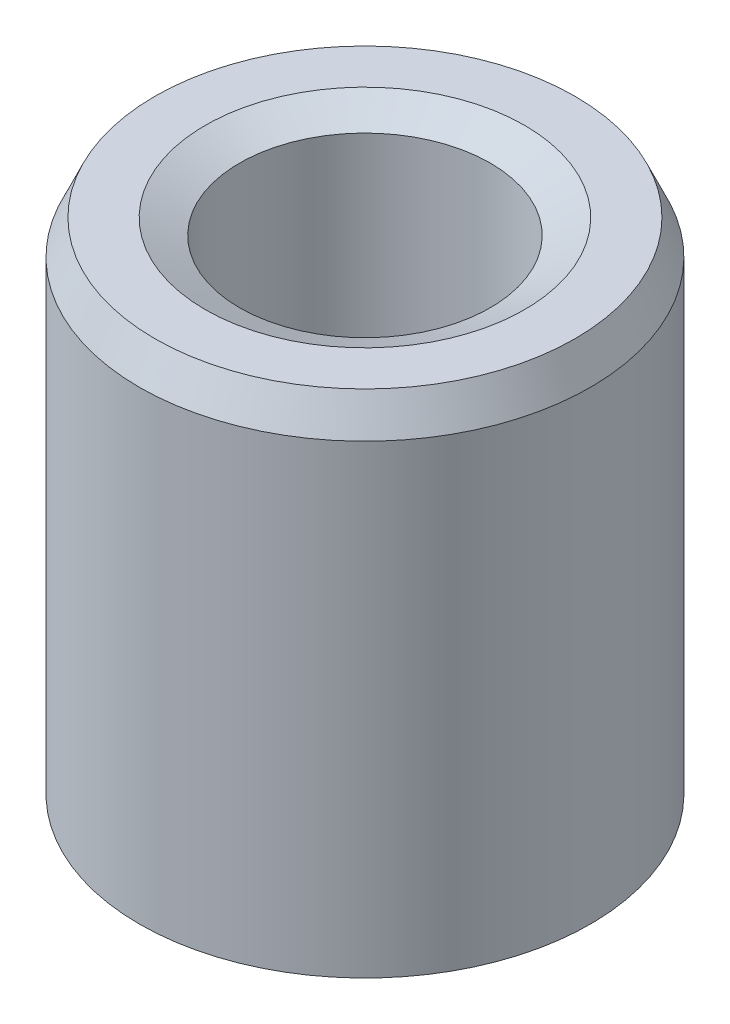
ISO-10303-21;
HEADER;
FILE_DESCRIPTION(('STEP AP214'),'2;1');
FILE_NAME('part.step','',(''),(''),'','','');
FILE_SCHEMA(('AUTOMOTIVE_DESIGN { 1 0 10303 214 1 1 1 1 }'));
ENDSEC;
DATA;
#1=APPLICATION_CONTEXT('core data for automotive mechanical design processes');
#2=APPLICATION_PROTOCOL_DEFINITION('international standard','automotive_design',2000,#1);
#3=PRODUCT_CONTEXT('',#1,'mechanical');
#4=PRODUCT('Part','Part','',(#3));
#5=PRODUCT_RELATED_PRODUCT_CATEGORY('part','',(#4));
#6=PRODUCT_DEFINITION_FORMATION('','',#4);
#7=PRODUCT_DEFINITION_CONTEXT('part definition',#1,'design');
#8=PRODUCT_DEFINITION('design','',#6,#7);
#9=PRODUCT_DEFINITION_SHAPE('','',#8);
#10=(LENGTH_UNIT() NAMED_UNIT(*) SI_UNIT(.MILLI.,.METRE.));
#11=(NAMED_UNIT(*) PLANE_ANGLE_UNIT() SI_UNIT($,.RADIAN.));
#12=(NAMED_UNIT(*) SI_UNIT($,.STERADIAN.) SOLID_ANGLE_UNIT());
#13=UNCERTAINTY_MEASURE_WITH_UNIT(LENGTH_MEASURE(1.E-05),#10,'distance_accuracy_value','');
#14=(GEOMETRIC_REPRESENTATION_CONTEXT(3) GLOBAL_UNCERTAINTY_ASSIGNED_CONTEXT((#13)) GLOBAL_UNIT_ASSIGNED_CONTEXT((#10,
#11,#12)) REPRESENTATION_CONTEXT('',''));
#15=CARTESIAN_POINT('',(0.,0.,0.));
#16=DIRECTION('',(0.,0.,1.));
#17=DIRECTION('',(1.,0.,0.));
#18=AXIS2_PLACEMENT_3D('',#15,#16,#17);
#19=CARTESIAN_POINT('',(0.,11.4106421370154,0.));
#20=DIRECTION('',(0.,-1.,0.));
#21=DIRECTION('',(0.,0.,-1.));
#22=AXIS2_PLACEMENT_3D('',#19,#20,#21);
#23=CYLINDRICAL_SURFACE('',#22,5.);
#24=CARTESIAN_POINT('',(0.,0.343890399913747,0.));
#25=DIRECTION('',(0.,1.,0.));
#26=DIRECTION('',(0.,0.,1.));
#27=AXIS2_PLACEMENT_3D('',#24,#25,#26);
#28=CIRCLE('',#27,5.);
#29=CARTESIAN_POINT('',(0.,0.343890399913747,5.));
#30=VERTEX_POINT('',#29);
#31=EDGE_CURVE('E10',#30,#30,#28,.T.);
#32=ORIENTED_EDGE('',*,*,#31,.T.);
#33=EDGE_LOOP('',(#32));
#34=FACE_BOUND('',#33,.T.);
#35=CARTESIAN_POINT('',(0.,10.6501132874734,0.));
#36=DIRECTION('',(0.,1.,0.));
#37=DIRECTION('',(0.,0.,1.));
#38=AXIS2_PLACEMENT_3D('',#35,#36,#37);
#39=CIRCLE('',#38,5.);
#40=CARTESIAN_POINT('',(0.,10.6501132874734,5.));
#41=VERTEX_POINT('',#40);
#42=EDGE_CURVE('E50',#41,#41,#39,.F.);
#43=ORIENTED_EDGE('',*,*,#42,.T.);
#44=EDGE_LOOP('',(#43));
#45=FACE_BOUND('',#44,.T.);
#46=ADVANCED_FACE('F39',(#34,#45),#23,.T.);
#47=CARTESIAN_POINT('',(0.,11.4106421370154,0.));
#48=DIRECTION('',(0.,1.,0.));
#49=DIRECTION('',(0.,0.,1.));
#50=AXIS2_PLACEMENT_3D('',#47,#48,#49);
#51=PLANE('',#50);
#52=CARTESIAN_POINT('',(0.,11.4106421370154,0.));
#53=DIRECTION('',(0.,1.,0.));
#54=DIRECTION('',(0.,0.,1.));
#55=AXIS2_PLACEMENT_3D('',#52,#53,#54);
#56=CIRCLE('',#55,3.53954767072472);
#57=CARTESIAN_POINT('',(0.,11.4106421370154,3.53954767072472));
#58=VERTEX_POINT('',#57);
#59=EDGE_CURVE('E58',#58,#58,#56,.F.);
#60=ORIENTED_EDGE('',*,*,#59,.T.);
#61=EDGE_LOOP('',(#60));
#62=FACE_BOUND('',#61,.T.);
#63=CARTESIAN_POINT('',(0.,11.4106421370154,0.));
#64=DIRECTION('',(0.,1.,0.));
#65=DIRECTION('',(0.,0.,1.));
#66=AXIS2_PLACEMENT_3D('',#63,#64,#65);
#67=CIRCLE('',#66,4.65610960008625);
#68=CARTESIAN_POINT('',(0.,11.4106421370154,4.65610960008625));
#69=VERTEX_POINT('',#68);
#70=EDGE_CURVE('E61',#69,#69,#67,.T.);
#71=ORIENTED_EDGE('',*,*,#70,.T.);
#72=EDGE_LOOP('',(#71));
#73=FACE_BOUND('',#72,.T.);
#74=ADVANCED_FACE('F88',(#62,#73),#51,.T.);
#75=CARTESIAN_POINT('',(0.,0.,0.));
#76=DIRECTION('',(0.,1.,0.));
#77=DIRECTION('',(0.,0.,1.));
#78=AXIS2_PLACEMENT_3D('',#75,#76,#77);
#79=PLANE('',#78);
#80=CARTESIAN_POINT('',(0.,0.,0.));
#81=DIRECTION('',(0.,1.,0.));
#82=DIRECTION('',(0.,0.,1.));
#83=AXIS2_PLACEMENT_3D('',#80,#81,#82);
#84=CIRCLE('',#83,3.12290922109645);
#85=CARTESIAN_POINT('',(0.,0.,3.12290922109645));
#86=VERTEX_POINT('',#85);
#87=EDGE_CURVE('E51',#86,#86,#84,.T.);
#88=ORIENTED_EDGE('',*,*,#87,.T.);
#89=EDGE_LOOP('',(#88));
#90=FACE_BOUND('',#89,.T.);
#91=CARTESIAN_POINT('',(0.,0.,0.));
#92=DIRECTION('',(0.,1.,0.));
#93=DIRECTION('',(0.,0.,1.));
#94=AXIS2_PLACEMENT_3D('',#91,#92,#93);
#95=CIRCLE('',#94,4.23947115045799);
#96=CARTESIAN_POINT('',(0.,0.,4.23947115045799));
#97=VERTEX_POINT('',#96);
#98=EDGE_CURVE('E54',#97,#97,#95,.F.);
#99=ORIENTED_EDGE('',*,*,#98,.T.);
#100=EDGE_LOOP('',(#99));
#101=FACE_BOUND('',#100,.T.);
#102=ADVANCED_FACE('F83',(#90,#101),#79,.F.);
#103=CARTESIAN_POINT('',(0.,11.4106421370154,0.));
#104=DIRECTION('',(0.,-1.,0.));
#105=DIRECTION('',(0.,0.,-1.));
#106=AXIS2_PLACEMENT_3D('',#103,#104,#105);
#107=CYLINDRICAL_SURFACE('',#106,2.7790188211827);
#108=CARTESIAN_POINT('',(0.,11.0667517371017,0.));
#109=DIRECTION('',(0.,1.,0.));
#110=DIRECTION('',(0.,0.,1.));
#111=AXIS2_PLACEMENT_3D('',#108,#109,#110);
#112=CIRCLE('',#111,2.7790188211827);
#113=CARTESIAN_POINT('',(0.,11.0667517371017,2.7790188211827));
#114=VERTEX_POINT('',#113);
#115=EDGE_CURVE('E67',#114,#114,#112,.T.);
#116=ORIENTED_EDGE('',*,*,#115,.T.);
#117=EDGE_LOOP('',(#116));
#118=FACE_BOUND('',#117,.T.);
#119=CARTESIAN_POINT('',(0.,0.760528849542008,0.));
#120=DIRECTION('',(0.,1.,0.));
#121=DIRECTION('',(0.,0.,1.));
#122=AXIS2_PLACEMENT_3D('',#119,#120,#121);
#123=CIRCLE('',#122,2.7790188211827);
#124=CARTESIAN_POINT('',(0.,0.760528849542008,2.7790188211827));
#125=VERTEX_POINT('',#124);
#126=EDGE_CURVE('E69',#125,#125,#123,.F.);
#127=ORIENTED_EDGE('',*,*,#126,.T.);
#128=EDGE_LOOP('',(#127));
#129=FACE_BOUND('',#128,.T.);
#130=ADVANCED_FACE('F71',(#118,#129),#107,.F.);
#131=CARTESIAN_POINT('',(0.,11.0667517371017,0.));
#132=DIRECTION('',(0.,1.,0.));
#133=DIRECTION('',(0.,0.,1.));
#134=AXIS2_PLACEMENT_3D('',#131,#132,#133);
#135=CONICAL_SURFACE('',#134,2.7790188211827,1.14613703326183);
#136=ORIENTED_EDGE('',*,*,#59,.F.);
#137=EDGE_LOOP('',(#136));
#138=FACE_BOUND('',#137,.T.);
#139=ORIENTED_EDGE('',*,*,#115,.F.);
#140=EDGE_LOOP('',(#139));
#141=FACE_BOUND('',#140,.T.);
#142=ADVANCED_FACE('F77',(#138,#141),#135,.F.);
#143=CARTESIAN_POINT('',(0.,0.,0.));
#144=DIRECTION('',(0.,-1.,0.));
#145=DIRECTION('',(0.,0.,-1.));
#146=AXIS2_PLACEMENT_3D('',#143,#144,#145);
#147=CONICAL_SURFACE('',#146,3.12290922109645,0.424659293533071);
#148=ORIENTED_EDGE('',*,*,#126,.F.);
#149=EDGE_LOOP('',(#148));
#150=FACE_BOUND('',#149,.T.);
#151=ORIENTED_EDGE('',*,*,#87,.F.);
#152=EDGE_LOOP('',(#151));
#153=FACE_BOUND('',#152,.T.);
#154=ADVANCED_FACE('F73',(#150,#153),#147,.F.);
#155=CARTESIAN_POINT('',(0.,0.343890399913747,0.));
#156=DIRECTION('',(0.,1.,0.));
#157=DIRECTION('',(0.,0.,1.));
#158=AXIS2_PLACEMENT_3D('',#155,#156,#157);
#159=CONICAL_SURFACE('',#158,5.,1.14613703326182);
#160=ORIENTED_EDGE('',*,*,#98,.F.);
#161=EDGE_LOOP('',(#160));
#162=FACE_BOUND('',#161,.T.);
#163=ORIENTED_EDGE('',*,*,#31,.F.);
#164=EDGE_LOOP('',(#163));
#165=FACE_BOUND('',#164,.T.);
#166=ADVANCED_FACE('F76',(#162,#165),#159,.T.);
#167=CARTESIAN_POINT('',(0.,11.4106421370154,0.));
#168=DIRECTION('',(0.,-1.,0.));
#169=DIRECTION('',(0.,0.,-1.));
#170=AXIS2_PLACEMENT_3D('',#167,#168,#169);
#171=CONICAL_SURFACE('',#170,4.65610960008625,0.424659293533073);
#172=ORIENTED_EDGE('',*,*,#42,.F.);
#173=EDGE_LOOP('',(#172));
#174=FACE_BOUND('',#173,.T.);
#175=ORIENTED_EDGE('',*,*,#70,.F.);
#176=EDGE_LOOP('',(#175));
#177=FACE_BOUND('',#176,.T.);
#178=ADVANCED_FACE('F45',(#174,#177),#171,.T.);
#179=CLOSED_SHELL('',(#46,#74,#102,#130,#142,#154,#166,#178));
#180=MANIFOLD_SOLID_BREP('B2',#179);
#181=ADVANCED_BREP_SHAPE_REPRESENTATION('',(#18,#180),#14);
#182=SHAPE_DEFINITION_REPRESENTATION(#9,#181);
ENDSEC;
END-ISO-10303-21;
